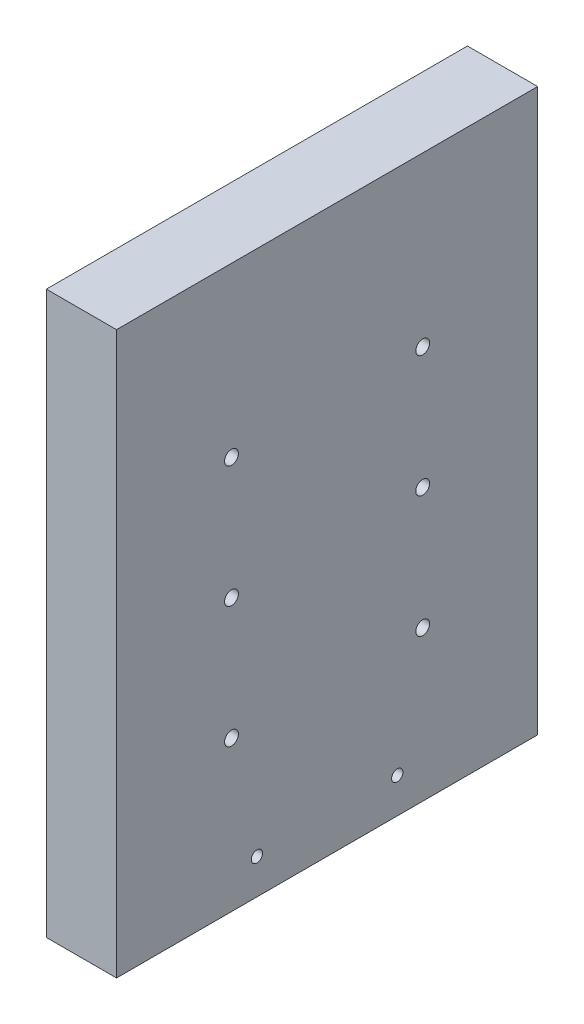
ISO-10303-21;
HEADER;
FILE_DESCRIPTION(('STEP AP214'),'2;1');
FILE_NAME('part.step','',(''),(''),'','','');
FILE_SCHEMA(('AUTOMOTIVE_DESIGN { 1 0 10303 214 1 1 1 1 }'));
ENDSEC;
DATA;
#1=APPLICATION_CONTEXT('core data for automotive mechanical design processes');
#2=APPLICATION_PROTOCOL_DEFINITION('international standard','automotive_design',2000,#1);
#3=PRODUCT_CONTEXT('',#1,'mechanical');
#4=PRODUCT('Part','Part','',(#3));
#5=PRODUCT_RELATED_PRODUCT_CATEGORY('part','',(#4));
#6=PRODUCT_DEFINITION_FORMATION('','',#4);
#7=PRODUCT_DEFINITION_CONTEXT('part definition',#1,'design');
#8=PRODUCT_DEFINITION('design','',#6,#7);
#9=PRODUCT_DEFINITION_SHAPE('','',#8);
#10=(LENGTH_UNIT() NAMED_UNIT(*) SI_UNIT(.MILLI.,.METRE.));
#11=(NAMED_UNIT(*) PLANE_ANGLE_UNIT() SI_UNIT($,.RADIAN.));
#12=(NAMED_UNIT(*) SI_UNIT($,.STERADIAN.) SOLID_ANGLE_UNIT());
#13=UNCERTAINTY_MEASURE_WITH_UNIT(LENGTH_MEASURE(1.E-05),#10,'distance_accuracy_value','');
#14=(GEOMETRIC_REPRESENTATION_CONTEXT(3) GLOBAL_UNCERTAINTY_ASSIGNED_CONTEXT((#13)) GLOBAL_UNIT_ASSIGNED_CONTEXT((#10,
#11,#12)) REPRESENTATION_CONTEXT('',''));
#15=CARTESIAN_POINT('',(0.,0.,0.));
#16=DIRECTION('',(0.,0.,1.));
#17=DIRECTION('',(1.,0.,0.));
#18=AXIS2_PLACEMENT_3D('',#15,#16,#17);
#19=CARTESIAN_POINT('',(12.7,0.,38.1));
#20=DIRECTION('',(0.,0.,-1.));
#21=DIRECTION('',(-1.,0.,0.));
#22=AXIS2_PLACEMENT_3D('',#19,#20,#21);
#23=PLANE('',#22);
#24=DIRECTION('',(0.,-1.,0.));
#25=VECTOR('',#24,1.);
#26=CARTESIAN_POINT('',(0.,0.,38.1));
#27=LINE('',#26,#25);
#28=CARTESIAN_POINT('',(0.,101.6,38.1));
#29=VERTEX_POINT('',#28);
#30=CARTESIAN_POINT('',(0.,0.,38.1));
#31=VERTEX_POINT('',#30);
#32=EDGE_CURVE('E97',#29,#31,#27,.T.);
#33=ORIENTED_EDGE('',*,*,#32,.T.);
#34=DIRECTION('',(-1.,0.,0.));
#35=VECTOR('',#34,1.);
#36=CARTESIAN_POINT('',(12.7,0.,38.1));
#37=LINE('',#36,#35);
#38=CARTESIAN_POINT('',(12.7,0.,38.1));
#39=VERTEX_POINT('',#38);
#40=EDGE_CURVE('E11',#39,#31,#37,.T.);
#41=ORIENTED_EDGE('',*,*,#40,.F.);
#42=DIRECTION('',(0.,-1.,0.));
#43=VECTOR('',#42,1.);
#44=CARTESIAN_POINT('',(12.7,0.,38.1));
#45=LINE('',#44,#43);
#46=CARTESIAN_POINT('',(12.7,101.6,38.1));
#47=VERTEX_POINT('',#46);
#48=EDGE_CURVE('E85',#47,#39,#45,.T.);
#49=ORIENTED_EDGE('',*,*,#48,.F.);
#50=DIRECTION('',(-1.,0.,0.));
#51=VECTOR('',#50,1.);
#52=CARTESIAN_POINT('',(12.7,101.6,38.1));
#53=LINE('',#52,#51);
#54=EDGE_CURVE('E93',#47,#29,#53,.T.);
#55=ORIENTED_EDGE('',*,*,#54,.T.);
#56=EDGE_LOOP('',(#33,#41,#49,#55));
#57=FACE_BOUND('',#56,.T.);
#58=ADVANCED_FACE('F34',(#57),#23,.F.);
#59=CARTESIAN_POINT('',(12.7,0.,38.1));
#60=DIRECTION('',(0.,1.,0.));
#61=DIRECTION('',(0.,0.,1.));
#62=AXIS2_PLACEMENT_3D('',#59,#60,#61);
#63=PLANE('',#62);
#64=DIRECTION('',(0.,0.,-1.));
#65=VECTOR('',#64,1.);
#66=CARTESIAN_POINT('',(0.,0.,38.1));
#67=LINE('',#66,#65);
#68=CARTESIAN_POINT('',(0.,0.,-38.1));
#69=VERTEX_POINT('',#68);
#70=EDGE_CURVE('E89',#31,#69,#67,.T.);
#71=ORIENTED_EDGE('',*,*,#70,.T.);
#72=DIRECTION('',(-1.,0.,0.));
#73=VECTOR('',#72,1.);
#74=CARTESIAN_POINT('',(12.7,0.,-38.1));
#75=LINE('',#74,#73);
#76=CARTESIAN_POINT('',(12.7,0.,-38.1));
#77=VERTEX_POINT('',#76);
#78=EDGE_CURVE('E42',#77,#69,#75,.T.);
#79=ORIENTED_EDGE('',*,*,#78,.F.);
#80=DIRECTION('',(0.,0.,-1.));
#81=VECTOR('',#80,1.);
#82=CARTESIAN_POINT('',(12.7,0.,38.1));
#83=LINE('',#82,#81);
#84=EDGE_CURVE('E80',#39,#77,#83,.T.);
#85=ORIENTED_EDGE('',*,*,#84,.F.);
#86=ORIENTED_EDGE('',*,*,#40,.T.);
#87=EDGE_LOOP('',(#71,#79,#85,#86));
#88=FACE_BOUND('',#87,.T.);
#89=ADVANCED_FACE('F88',(#88),#63,.F.);
#90=CARTESIAN_POINT('',(12.7,0.,-38.1));
#91=DIRECTION('',(0.,0.,1.));
#92=DIRECTION('',(1.,0.,0.));
#93=AXIS2_PLACEMENT_3D('',#90,#91,#92);
#94=PLANE('',#93);
#95=DIRECTION('',(0.,1.,0.));
#96=VECTOR('',#95,1.);
#97=CARTESIAN_POINT('',(0.,0.,-38.1));
#98=LINE('',#97,#96);
#99=CARTESIAN_POINT('',(0.,101.6,-38.1));
#100=VERTEX_POINT('',#99);
#101=EDGE_CURVE('E67',#69,#100,#98,.T.);
#102=ORIENTED_EDGE('',*,*,#101,.T.);
#103=DIRECTION('',(-1.,0.,0.));
#104=VECTOR('',#103,1.);
#105=CARTESIAN_POINT('',(12.7,101.6,-38.1));
#106=LINE('',#105,#104);
#107=CARTESIAN_POINT('',(12.7,101.6,-38.1));
#108=VERTEX_POINT('',#107);
#109=EDGE_CURVE('E90',#108,#100,#106,.T.);
#110=ORIENTED_EDGE('',*,*,#109,.F.);
#111=DIRECTION('',(0.,1.,0.));
#112=VECTOR('',#111,1.);
#113=CARTESIAN_POINT('',(12.7,0.,-38.1));
#114=LINE('',#113,#112);
#115=EDGE_CURVE('E83',#77,#108,#114,.T.);
#116=ORIENTED_EDGE('',*,*,#115,.F.);
#117=ORIENTED_EDGE('',*,*,#78,.T.);
#118=EDGE_LOOP('',(#102,#110,#116,#117));
#119=FACE_BOUND('',#118,.T.);
#120=ADVANCED_FACE('F91',(#119),#94,.F.);
#121=CARTESIAN_POINT('',(12.7,101.6,38.1));
#122=DIRECTION('',(0.,-1.,0.));
#123=DIRECTION('',(0.,0.,-1.));
#124=AXIS2_PLACEMENT_3D('',#121,#122,#123);
#125=PLANE('',#124);
#126=DIRECTION('',(0.,0.,1.));
#127=VECTOR('',#126,1.);
#128=CARTESIAN_POINT('',(0.,101.6,38.1));
#129=LINE('',#128,#127);
#130=EDGE_CURVE('E73',#100,#29,#129,.T.);
#131=ORIENTED_EDGE('',*,*,#130,.T.);
#132=ORIENTED_EDGE('',*,*,#54,.F.);
#133=DIRECTION('',(0.,0.,1.));
#134=VECTOR('',#133,1.);
#135=CARTESIAN_POINT('',(12.7,101.6,38.1));
#136=LINE('',#135,#134);
#137=EDGE_CURVE('E50',#108,#47,#136,.T.);
#138=ORIENTED_EDGE('',*,*,#137,.F.);
#139=ORIENTED_EDGE('',*,*,#109,.T.);
#140=EDGE_LOOP('',(#131,#132,#138,#139));
#141=FACE_BOUND('',#140,.T.);
#142=ADVANCED_FACE('F105',(#141),#125,.F.);
#143=CARTESIAN_POINT('',(12.7,0.,0.));
#144=DIRECTION('',(-1.,0.,0.));
#145=DIRECTION('',(0.,0.,1.));
#146=AXIS2_PLACEMENT_3D('',#143,#144,#145);
#147=PLANE('',#146);
#148=CARTESIAN_POINT('',(12.7,6.35,12.7));
#149=DIRECTION('',(1.,0.,0.));
#150=DIRECTION('',(0.,0.,-1.));
#151=AXIS2_PLACEMENT_3D('',#148,#149,#150);
#152=CIRCLE('',#151,1.025);
#153=CARTESIAN_POINT('',(12.7,6.35,11.675));
#154=VERTEX_POINT('',#153);
#155=EDGE_CURVE('E161',#154,#154,#152,.T.);
#156=ORIENTED_EDGE('',*,*,#155,.F.);
#157=EDGE_LOOP('',(#156));
#158=FACE_BOUND('',#157,.T.);
#159=CARTESIAN_POINT('',(12.7,6.35,-12.7));
#160=DIRECTION('',(1.,0.,0.));
#161=DIRECTION('',(0.,0.,-1.));
#162=AXIS2_PLACEMENT_3D('',#159,#160,#161);
#163=CIRCLE('',#162,1.025);
#164=CARTESIAN_POINT('',(12.7,6.35,-13.725));
#165=VERTEX_POINT('',#164);
#166=EDGE_CURVE('E155',#165,#165,#163,.T.);
#167=ORIENTED_EDGE('',*,*,#166,.F.);
#168=EDGE_LOOP('',(#167));
#169=FACE_BOUND('',#168,.T.);
#170=CARTESIAN_POINT('',(12.7,71.2,17.3));
#171=DIRECTION('',(-1.,0.,0.));
#172=DIRECTION('',(0.,0.,1.));
#173=AXIS2_PLACEMENT_3D('',#170,#171,#172);
#174=CIRCLE('',#173,1.25);
#175=CARTESIAN_POINT('',(12.7,71.2,18.55));
#176=VERTEX_POINT('',#175);
#177=EDGE_CURVE('E140',#176,#176,#174,.T.);
#178=ORIENTED_EDGE('',*,*,#177,.T.);
#179=EDGE_LOOP('',(#178));
#180=FACE_BOUND('',#179,.T.);
#181=CARTESIAN_POINT('',(12.7,49.2,17.3));
#182=DIRECTION('',(-1.,0.,0.));
#183=DIRECTION('',(0.,0.,1.));
#184=AXIS2_PLACEMENT_3D('',#181,#182,#183);
#185=CIRCLE('',#184,1.25);
#186=CARTESIAN_POINT('',(12.7,49.2,18.55));
#187=VERTEX_POINT('',#186);
#188=EDGE_CURVE('E134',#187,#187,#185,.T.);
#189=ORIENTED_EDGE('',*,*,#188,.T.);
#190=EDGE_LOOP('',(#189));
#191=FACE_BOUND('',#190,.T.);
#192=CARTESIAN_POINT('',(12.7,27.2,17.3));
#193=DIRECTION('',(-1.,0.,0.));
#194=DIRECTION('',(0.,0.,1.));
#195=AXIS2_PLACEMENT_3D('',#192,#193,#194);
#196=CIRCLE('',#195,1.25);
#197=CARTESIAN_POINT('',(12.7,27.2,18.55));
#198=VERTEX_POINT('',#197);
#199=EDGE_CURVE('E128',#198,#198,#196,.T.);
#200=ORIENTED_EDGE('',*,*,#199,.T.);
#201=EDGE_LOOP('',(#200));
#202=FACE_BOUND('',#201,.T.);
#203=CARTESIAN_POINT('',(12.7,71.2,-17.3));
#204=DIRECTION('',(-1.,0.,0.));
#205=DIRECTION('',(0.,0.,1.));
#206=AXIS2_PLACEMENT_3D('',#203,#204,#205);
#207=CIRCLE('',#206,1.25);
#208=CARTESIAN_POINT('',(12.7,71.2,-16.05));
#209=VERTEX_POINT('',#208);
#210=EDGE_CURVE('E122',#209,#209,#207,.T.);
#211=ORIENTED_EDGE('',*,*,#210,.T.);
#212=EDGE_LOOP('',(#211));
#213=FACE_BOUND('',#212,.T.);
#214=CARTESIAN_POINT('',(12.7,49.2,-17.3));
#215=DIRECTION('',(-1.,0.,0.));
#216=DIRECTION('',(0.,0.,1.));
#217=AXIS2_PLACEMENT_3D('',#214,#215,#216);
#218=CIRCLE('',#217,1.25);
#219=CARTESIAN_POINT('',(12.7,49.2,-16.05));
#220=VERTEX_POINT('',#219);
#221=EDGE_CURVE('E116',#220,#220,#218,.T.);
#222=ORIENTED_EDGE('',*,*,#221,.T.);
#223=EDGE_LOOP('',(#222));
#224=FACE_BOUND('',#223,.T.);
#225=CARTESIAN_POINT('',(12.7,27.2,-17.3));
#226=DIRECTION('',(-1.,0.,0.));
#227=DIRECTION('',(0.,0.,1.));
#228=AXIS2_PLACEMENT_3D('',#225,#226,#227);
#229=CIRCLE('',#228,1.25);
#230=CARTESIAN_POINT('',(12.7,27.2,-16.05));
#231=VERTEX_POINT('',#230);
#232=EDGE_CURVE('E100',#231,#231,#229,.T.);
#233=ORIENTED_EDGE('',*,*,#232,.T.);
#234=EDGE_LOOP('',(#233));
#235=FACE_BOUND('',#234,.T.);
#236=ORIENTED_EDGE('',*,*,#48,.T.);
#237=ORIENTED_EDGE('',*,*,#84,.T.);
#238=ORIENTED_EDGE('',*,*,#115,.T.);
#239=ORIENTED_EDGE('',*,*,#137,.T.);
#240=EDGE_LOOP('',(#236,#237,#238,#239));
#241=FACE_BOUND('',#240,.T.);
#242=ADVANCED_FACE('F81',(#158,#169,#180,#191,#202,#213,#224,#235,#241),#147,.F.);
#243=CARTESIAN_POINT('',(0.,0.,0.));
#244=DIRECTION('',(-1.,0.,0.));
#245=DIRECTION('',(0.,0.,1.));
#246=AXIS2_PLACEMENT_3D('',#243,#244,#245);
#247=PLANE('',#246);
#248=CARTESIAN_POINT('',(0.,6.35,12.7));
#249=DIRECTION('',(1.,0.,0.));
#250=DIRECTION('',(0.,0.,-1.));
#251=AXIS2_PLACEMENT_3D('',#248,#249,#250);
#252=CIRCLE('',#251,1.025);
#253=CARTESIAN_POINT('',(0.,6.35,11.675));
#254=VERTEX_POINT('',#253);
#255=EDGE_CURVE('E158',#254,#254,#252,.T.);
#256=ORIENTED_EDGE('',*,*,#255,.T.);
#257=EDGE_LOOP('',(#256));
#258=FACE_BOUND('',#257,.T.);
#259=CARTESIAN_POINT('',(0.,6.35,-12.7));
#260=DIRECTION('',(1.,0.,0.));
#261=DIRECTION('',(0.,0.,-1.));
#262=AXIS2_PLACEMENT_3D('',#259,#260,#261);
#263=CIRCLE('',#262,1.025);
#264=CARTESIAN_POINT('',(0.,6.35,-13.725));
#265=VERTEX_POINT('',#264);
#266=EDGE_CURVE('E150',#265,#265,#263,.T.);
#267=ORIENTED_EDGE('',*,*,#266,.T.);
#268=EDGE_LOOP('',(#267));
#269=FACE_BOUND('',#268,.T.);
#270=CARTESIAN_POINT('',(0.,67.2,0.));
#271=DIRECTION('',(-1.,0.,0.));
#272=DIRECTION('',(0.,0.,1.));
#273=AXIS2_PLACEMENT_3D('',#270,#271,#272);
#274=CIRCLE('',#273,5.);
#275=CARTESIAN_POINT('',(0.,67.2,5.));
#276=VERTEX_POINT('',#275);
#277=EDGE_CURVE('E147',#276,#276,#274,.T.);
#278=ORIENTED_EDGE('',*,*,#277,.F.);
#279=EDGE_LOOP('',(#278));
#280=FACE_BOUND('',#279,.T.);
#281=CARTESIAN_POINT('',(0.,71.2,17.3));
#282=DIRECTION('',(-1.,0.,0.));
#283=DIRECTION('',(0.,0.,1.));
#284=AXIS2_PLACEMENT_3D('',#281,#282,#283);
#285=CIRCLE('',#284,1.24999999999999);
#286=CARTESIAN_POINT('',(0.,71.2,18.55));
#287=VERTEX_POINT('',#286);
#288=EDGE_CURVE('E143',#287,#287,#285,.T.);
#289=ORIENTED_EDGE('',*,*,#288,.F.);
#290=EDGE_LOOP('',(#289));
#291=FACE_BOUND('',#290,.T.);
#292=CARTESIAN_POINT('',(0.,49.2,17.3));
#293=DIRECTION('',(-1.,0.,0.));
#294=DIRECTION('',(0.,0.,1.));
#295=AXIS2_PLACEMENT_3D('',#292,#293,#294);
#296=CIRCLE('',#295,1.24999999999999);
#297=CARTESIAN_POINT('',(0.,49.2,18.55));
#298=VERTEX_POINT('',#297);
#299=EDGE_CURVE('E137',#298,#298,#296,.T.);
#300=ORIENTED_EDGE('',*,*,#299,.F.);
#301=EDGE_LOOP('',(#300));
#302=FACE_BOUND('',#301,.T.);
#303=CARTESIAN_POINT('',(0.,27.2,17.3));
#304=DIRECTION('',(-1.,0.,0.));
#305=DIRECTION('',(0.,0.,1.));
#306=AXIS2_PLACEMENT_3D('',#303,#304,#305);
#307=CIRCLE('',#306,1.24999999999999);
#308=CARTESIAN_POINT('',(0.,27.2,18.55));
#309=VERTEX_POINT('',#308);
#310=EDGE_CURVE('E131',#309,#309,#307,.T.);
#311=ORIENTED_EDGE('',*,*,#310,.F.);
#312=EDGE_LOOP('',(#311));
#313=FACE_BOUND('',#312,.T.);
#314=CARTESIAN_POINT('',(0.,71.2,-17.3));
#315=DIRECTION('',(-1.,0.,0.));
#316=DIRECTION('',(0.,0.,1.));
#317=AXIS2_PLACEMENT_3D('',#314,#315,#316);
#318=CIRCLE('',#317,1.24999999999999);
#319=CARTESIAN_POINT('',(0.,71.2,-16.05));
#320=VERTEX_POINT('',#319);
#321=EDGE_CURVE('E125',#320,#320,#318,.T.);
#322=ORIENTED_EDGE('',*,*,#321,.F.);
#323=EDGE_LOOP('',(#322));
#324=FACE_BOUND('',#323,.T.);
#325=CARTESIAN_POINT('',(0.,49.2,-17.3));
#326=DIRECTION('',(-1.,0.,0.));
#327=DIRECTION('',(0.,0.,1.));
#328=AXIS2_PLACEMENT_3D('',#325,#326,#327);
#329=CIRCLE('',#328,1.24999999999999);
#330=CARTESIAN_POINT('',(0.,49.2,-16.05));
#331=VERTEX_POINT('',#330);
#332=EDGE_CURVE('E119',#331,#331,#329,.T.);
#333=ORIENTED_EDGE('',*,*,#332,.F.);
#334=EDGE_LOOP('',(#333));
#335=FACE_BOUND('',#334,.T.);
#336=CARTESIAN_POINT('',(0.,27.2,-17.3));
#337=DIRECTION('',(-1.,0.,0.));
#338=DIRECTION('',(0.,0.,1.));
#339=AXIS2_PLACEMENT_3D('',#336,#337,#338);
#340=CIRCLE('',#339,1.24999999999999);
#341=CARTESIAN_POINT('',(0.,27.2,-16.05));
#342=VERTEX_POINT('',#341);
#343=EDGE_CURVE('E113',#342,#342,#340,.T.);
#344=ORIENTED_EDGE('',*,*,#343,.F.);
#345=EDGE_LOOP('',(#344));
#346=FACE_BOUND('',#345,.T.);
#347=ORIENTED_EDGE('',*,*,#32,.F.);
#348=ORIENTED_EDGE('',*,*,#130,.F.);
#349=ORIENTED_EDGE('',*,*,#101,.F.);
#350=ORIENTED_EDGE('',*,*,#70,.F.);
#351=EDGE_LOOP('',(#347,#348,#349,#350));
#352=FACE_BOUND('',#351,.T.);
#353=ADVANCED_FACE('F108',(#258,#269,#280,#291,#302,#313,#324,#335,#346,#352),#247,.T.);
#354=CARTESIAN_POINT('',(0.,27.2,-17.3));
#355=DIRECTION('',(-1.,0.,0.));
#356=DIRECTION('',(0.,0.,1.));
#357=AXIS2_PLACEMENT_3D('',#354,#355,#356);
#358=CYLINDRICAL_SURFACE('',#357,1.24999999999999);
#359=ORIENTED_EDGE('',*,*,#232,.F.);
#360=EDGE_LOOP('',(#359));
#361=FACE_BOUND('',#360,.T.);
#362=ORIENTED_EDGE('',*,*,#343,.T.);
#363=EDGE_LOOP('',(#362));
#364=FACE_BOUND('',#363,.T.);
#365=ADVANCED_FACE('F184',(#361,#364),#358,.F.);
#366=CARTESIAN_POINT('',(0.,49.2,-17.3));
#367=DIRECTION('',(-1.,0.,0.));
#368=DIRECTION('',(0.,0.,1.));
#369=AXIS2_PLACEMENT_3D('',#366,#367,#368);
#370=CYLINDRICAL_SURFACE('',#369,1.24999999999999);
#371=ORIENTED_EDGE('',*,*,#221,.F.);
#372=EDGE_LOOP('',(#371));
#373=FACE_BOUND('',#372,.T.);
#374=ORIENTED_EDGE('',*,*,#332,.T.);
#375=EDGE_LOOP('',(#374));
#376=FACE_BOUND('',#375,.T.);
#377=ADVANCED_FACE('F187',(#373,#376),#370,.F.);
#378=CARTESIAN_POINT('',(0.,71.2,-17.3));
#379=DIRECTION('',(-1.,0.,0.));
#380=DIRECTION('',(0.,0.,1.));
#381=AXIS2_PLACEMENT_3D('',#378,#379,#380);
#382=CYLINDRICAL_SURFACE('',#381,1.24999999999999);
#383=ORIENTED_EDGE('',*,*,#210,.F.);
#384=EDGE_LOOP('',(#383));
#385=FACE_BOUND('',#384,.T.);
#386=ORIENTED_EDGE('',*,*,#321,.T.);
#387=EDGE_LOOP('',(#386));
#388=FACE_BOUND('',#387,.T.);
#389=ADVANCED_FACE('F269',(#385,#388),#382,.F.);
#390=CARTESIAN_POINT('',(0.,27.2,17.3));
#391=DIRECTION('',(-1.,0.,0.));
#392=DIRECTION('',(0.,0.,1.));
#393=AXIS2_PLACEMENT_3D('',#390,#391,#392);
#394=CYLINDRICAL_SURFACE('',#393,1.24999999999999);
#395=ORIENTED_EDGE('',*,*,#199,.F.);
#396=EDGE_LOOP('',(#395));
#397=FACE_BOUND('',#396,.T.);
#398=ORIENTED_EDGE('',*,*,#310,.T.);
#399=EDGE_LOOP('',(#398));
#400=FACE_BOUND('',#399,.T.);
#401=ADVANCED_FACE('F265',(#397,#400),#394,.F.);
#402=CARTESIAN_POINT('',(0.,49.2,17.3));
#403=DIRECTION('',(-1.,0.,0.));
#404=DIRECTION('',(0.,0.,1.));
#405=AXIS2_PLACEMENT_3D('',#402,#403,#404);
#406=CYLINDRICAL_SURFACE('',#405,1.24999999999999);
#407=ORIENTED_EDGE('',*,*,#188,.F.);
#408=EDGE_LOOP('',(#407));
#409=FACE_BOUND('',#408,.T.);
#410=ORIENTED_EDGE('',*,*,#299,.T.);
#411=EDGE_LOOP('',(#410));
#412=FACE_BOUND('',#411,.T.);
#413=ADVANCED_FACE('F261',(#409,#412),#406,.F.);
#414=CARTESIAN_POINT('',(0.,71.2,17.3));
#415=DIRECTION('',(-1.,0.,0.));
#416=DIRECTION('',(0.,0.,1.));
#417=AXIS2_PLACEMENT_3D('',#414,#415,#416);
#418=CYLINDRICAL_SURFACE('',#417,1.24999999999999);
#419=ORIENTED_EDGE('',*,*,#177,.F.);
#420=EDGE_LOOP('',(#419));
#421=FACE_BOUND('',#420,.T.);
#422=ORIENTED_EDGE('',*,*,#288,.T.);
#423=EDGE_LOOP('',(#422));
#424=FACE_BOUND('',#423,.T.);
#425=ADVANCED_FACE('F257',(#421,#424),#418,.F.);
#426=CARTESIAN_POINT('',(2.5,67.2,0.));
#427=DIRECTION('',(-1.,0.,0.));
#428=DIRECTION('',(0.,0.,1.));
#429=AXIS2_PLACEMENT_3D('',#426,#427,#428);
#430=CYLINDRICAL_SURFACE('',#429,5.);
#431=CARTESIAN_POINT('',(2.5,67.2,0.));
#432=DIRECTION('',(-1.,0.,0.));
#433=DIRECTION('',(0.,0.,1.));
#434=AXIS2_PLACEMENT_3D('',#431,#432,#433);
#435=CIRCLE('',#434,5.);
#436=CARTESIAN_POINT('',(2.5,67.2,5.));
#437=VERTEX_POINT('',#436);
#438=EDGE_CURVE('E146',#437,#437,#435,.T.);
#439=ORIENTED_EDGE('',*,*,#438,.F.);
#440=EDGE_LOOP('',(#439));
#441=FACE_BOUND('',#440,.T.);
#442=ORIENTED_EDGE('',*,*,#277,.T.);
#443=EDGE_LOOP('',(#442));
#444=FACE_BOUND('',#443,.T.);
#445=ADVANCED_FACE('F253',(#441,#444),#430,.F.);
#446=CARTESIAN_POINT('',(2.5,67.2,0.));
#447=DIRECTION('',(-1.,0.,0.));
#448=DIRECTION('',(0.,0.,1.));
#449=AXIS2_PLACEMENT_3D('',#446,#447,#448);
#450=PLANE('',#449);
#451=ORIENTED_EDGE('',*,*,#438,.T.);
#452=EDGE_LOOP('',(#451));
#453=FACE_BOUND('',#452,.T.);
#454=ADVANCED_FACE('F222',(#453),#450,.T.);
#455=CARTESIAN_POINT('',(12.7,6.35,-12.7));
#456=DIRECTION('',(1.,0.,0.));
#457=DIRECTION('',(0.,0.,-1.));
#458=AXIS2_PLACEMENT_3D('',#455,#456,#457);
#459=CYLINDRICAL_SURFACE('',#458,1.025);
#460=ORIENTED_EDGE('',*,*,#266,.F.);
#461=EDGE_LOOP('',(#460));
#462=FACE_BOUND('',#461,.T.);
#463=ORIENTED_EDGE('',*,*,#166,.T.);
#464=EDGE_LOOP('',(#463));
#465=FACE_BOUND('',#464,.T.);
#466=ADVANCED_FACE('F232',(#462,#465),#459,.F.);
#467=CARTESIAN_POINT('',(12.7,6.35,12.7));
#468=DIRECTION('',(1.,0.,0.));
#469=DIRECTION('',(0.,0.,-1.));
#470=AXIS2_PLACEMENT_3D('',#467,#468,#469);
#471=CYLINDRICAL_SURFACE('',#470,1.025);
#472=ORIENTED_EDGE('',*,*,#255,.F.);
#473=EDGE_LOOP('',(#472));
#474=FACE_BOUND('',#473,.T.);
#475=ORIENTED_EDGE('',*,*,#155,.T.);
#476=EDGE_LOOP('',(#475));
#477=FACE_BOUND('',#476,.T.);
#478=ADVANCED_FACE('F165',(#474,#477),#471,.F.);
#479=CLOSED_SHELL('',(#58,#89,#120,#142,#242,#353,#365,#377,#389,#401,#413,#425,#445,#454,#466,#478));
#480=MANIFOLD_SOLID_BREP('B2',#479);
#481=ADVANCED_BREP_SHAPE_REPRESENTATION('',(#18,#480),#14);
#482=SHAPE_DEFINITION_REPRESENTATION(#9,#481);
ENDSEC;
END-ISO-10303-21;
